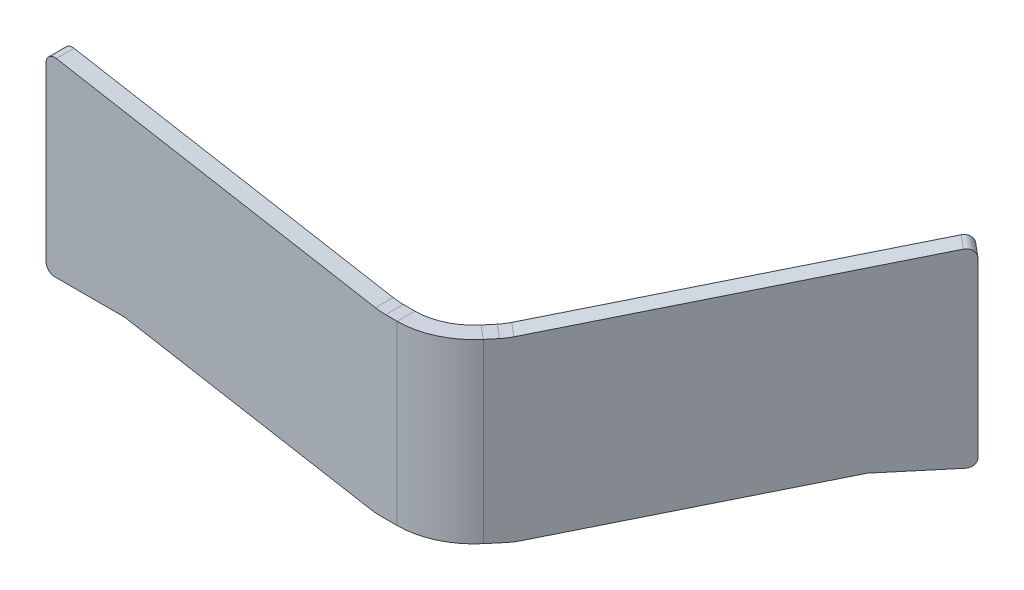
ISO-10303-21;
HEADER;
FILE_DESCRIPTION(('STEP AP214'),'2;1');
FILE_NAME('part.step','',(''),(''),'','','');
FILE_SCHEMA(('AUTOMOTIVE_DESIGN { 1 0 10303 214 1 1 1 1 }'));
ENDSEC;
DATA;
#1=APPLICATION_CONTEXT('core data for automotive mechanical design processes');
#2=APPLICATION_PROTOCOL_DEFINITION('international standard','automotive_design',2000,#1);
#3=PRODUCT_CONTEXT('',#1,'mechanical');
#4=PRODUCT('Part','Part','',(#3));
#5=PRODUCT_RELATED_PRODUCT_CATEGORY('part','',(#4));
#6=PRODUCT_DEFINITION_FORMATION('','',#4);
#7=PRODUCT_DEFINITION_CONTEXT('part definition',#1,'design');
#8=PRODUCT_DEFINITION('design','',#6,#7);
#9=PRODUCT_DEFINITION_SHAPE('','',#8);
#10=(LENGTH_UNIT() NAMED_UNIT(*) SI_UNIT(.MILLI.,.METRE.));
#11=(NAMED_UNIT(*) PLANE_ANGLE_UNIT() SI_UNIT($,.RADIAN.));
#12=(NAMED_UNIT(*) SI_UNIT($,.STERADIAN.) SOLID_ANGLE_UNIT());
#13=UNCERTAINTY_MEASURE_WITH_UNIT(LENGTH_MEASURE(1.E-05),#10,'distance_accuracy_value','');
#14=(GEOMETRIC_REPRESENTATION_CONTEXT(3) GLOBAL_UNCERTAINTY_ASSIGNED_CONTEXT((#13)) GLOBAL_UNIT_ASSIGNED_CONTEXT((#10,
#11,#12)) REPRESENTATION_CONTEXT('',''));
#15=CARTESIAN_POINT('',(0.,0.,0.));
#16=DIRECTION('',(0.,0.,1.));
#17=DIRECTION('',(1.,0.,0.));
#18=AXIS2_PLACEMENT_3D('',#15,#16,#17);
#19=CARTESIAN_POINT('',(84.6111995869186,-29.2123696111087,-92.2096152605912));
#20=DIRECTION('',(0.766044443118979,0.,0.642787609686538));
#21=DIRECTION('',(0.642787609686538,0.,-0.766044443118979));
#22=AXIS2_PLACEMENT_3D('',#19,#20,#21);
#23=PLANE('',#22);
#24=DIRECTION('',(0.642787609686538,0.,-0.766044443118979));
#25=VECTOR('',#24,1.);
#26=CARTESIAN_POINT('',(-5.26631461128302,12.7876303888913,14.902235178553));
#27=LINE('',#26,#25);
#28=CARTESIAN_POINT('',(9.99670405275767,12.7876303888913,-3.28752214815001));
#29=VERTEX_POINT('',#28);
#30=CARTESIAN_POINT('',(12.5062361441126,12.7876303888913,-6.27826603375275));
#31=VERTEX_POINT('',#30);
#32=EDGE_CURVE('E201',#29,#31,#27,.T.);
#33=ORIENTED_EDGE('',*,*,#32,.F.);
#34=DIRECTION('',(0.,-1.,0.));
#35=VECTOR('',#34,1.);
#36=CARTESIAN_POINT('',(9.99670405275767,-29.2123696111087,-3.28752214815001));
#37=LINE('',#36,#35);
#38=CARTESIAN_POINT('',(9.99670405275766,-47.2123696111086,-3.28752214815001));
#39=VERTEX_POINT('',#38);
#40=EDGE_CURVE('E47',#29,#39,#37,.T.);
#41=ORIENTED_EDGE('',*,*,#40,.T.);
#42=DIRECTION('',(0.642787609686538,0.,-0.766044443118979));
#43=VECTOR('',#42,1.);
#44=CARTESIAN_POINT('',(-6.37395997421112,-47.2123696111086,16.2222755191429));
#45=LINE('',#44,#43);
#46=CARTESIAN_POINT('',(13.6138815070407,-47.2123696111086,-7.59830637434266));
#47=VERTEX_POINT('',#46);
#48=EDGE_CURVE('E146',#39,#47,#45,.T.);
#49=ORIENTED_EDGE('',*,*,#48,.T.);
#50=CARTESIAN_POINT('',(13.6138815070407,-27.2123696111086,-7.59830637434265));
#51=DIRECTION('',(-0.766044443118979,0.,-0.642787609686538));
#52=DIRECTION('',(-0.642787609686538,0.,0.766044443118979));
#53=AXIS2_PLACEMENT_3D('',#50,#51,#52);
#54=CIRCLE('',#53,20.);
#55=CARTESIAN_POINT('',(15.8462594480198,-46.9085246713527,-10.2587508055325));
#56=VERTEX_POINT('',#55);
#57=EDGE_CURVE('E131',#56,#47,#54,.T.);
#58=ORIENTED_EDGE('',*,*,#57,.F.);
#59=DIRECTION('',(-0.633022221559488,-0.173648177666927,0.754406506735491));
#60=VECTOR('',#59,1.);
#61=CARTESIAN_POINT('',(69.4200593554533,-32.2123696111086,-74.10551931414));
#62=LINE('',#61,#60);
#63=CARTESIAN_POINT('',(69.4200593554533,-32.2123696111086,-74.10551931414));
#64=VERTEX_POINT('',#63);
#65=EDGE_CURVE('E143',#64,#56,#62,.T.);
#66=ORIENTED_EDGE('',*,*,#65,.F.);
#67=DIRECTION('',(-0.642787609686538,0.,0.766044443118979));
#68=VECTOR('',#67,1.);
#69=CARTESIAN_POINT('',(84.6111995869186,-32.2123696111087,-92.2096152605912));
#70=LINE('',#69,#68);
#71=CARTESIAN_POINT('',(84.6111995869186,-32.2123696111087,-92.2096152605912));
#72=VERTEX_POINT('',#71);
#73=EDGE_CURVE('E150',#72,#64,#70,.T.);
#74=ORIENTED_EDGE('',*,*,#73,.F.);
#75=CARTESIAN_POINT('',(84.6111995869186,-29.2123696111087,-92.2096152605912));
#76=DIRECTION('',(0.766044443118979,0.,0.642787609686538));
#77=DIRECTION('',(0.642787609686538,0.,-0.766044443118979));
#78=AXIS2_PLACEMENT_3D('',#75,#76,#77);
#79=CIRCLE('',#78,2.99999999999998);
#80=CARTESIAN_POINT('',(86.5395624159782,-29.2123696111087,-94.5077485899482));
#81=VERTEX_POINT('',#80);
#82=EDGE_CURVE('E105',#72,#81,#79,.T.);
#83=ORIENTED_EDGE('',*,*,#82,.T.);
#84=DIRECTION('',(0.,-1.,0.));
#85=VECTOR('',#84,1.);
#86=CARTESIAN_POINT('',(86.5395624159782,29.2123696111087,-94.5077485899482));
#87=LINE('',#86,#85);
#88=CARTESIAN_POINT('',(86.5395624159782,29.2123696111087,-94.5077485899482));
#89=VERTEX_POINT('',#88);
#90=EDGE_CURVE('E220',#89,#81,#87,.T.);
#91=ORIENTED_EDGE('',*,*,#90,.F.);
#92=CARTESIAN_POINT('',(84.6111995869186,29.2123696111087,-92.2096152605912));
#93=DIRECTION('',(0.766044443118979,0.,0.642787609686538));
#94=DIRECTION('',(0.642787609686538,0.,-0.766044443118979));
#95=AXIS2_PLACEMENT_3D('',#92,#93,#94);
#96=CIRCLE('',#95,2.99999999999999);
#97=CARTESIAN_POINT('',(84.2763428957717,32.1667928701453,-91.8105485959127));
#98=VERTEX_POINT('',#97);
#99=EDGE_CURVE('E218',#89,#98,#96,.T.);
#100=ORIENTED_EDGE('',*,*,#99,.T.);
#101=DIRECTION('',(-0.633022221559488,-0.173648177666931,0.75440650673549));
#102=VECTOR('',#101,1.);
#103=CARTESIAN_POINT('',(84.2763428957717,32.1667928701453,-91.8105485959127));
#104=LINE('',#103,#102);
#105=CARTESIAN_POINT('',(14.7386140850916,13.0914753286472,-8.93871046494255));
#106=VERTEX_POINT('',#105);
#107=EDGE_CURVE('E216',#98,#106,#104,.T.);
#108=ORIENTED_EDGE('',*,*,#107,.T.);
#109=CARTESIAN_POINT('',(12.5062361441126,32.7876303888913,-6.27826603375275));
#110=DIRECTION('',(-0.766044443118979,0.,-0.642787609686538));
#111=DIRECTION('',(-0.642787609686538,0.,0.766044443118979));
#112=AXIS2_PLACEMENT_3D('',#109,#110,#111);
#113=CIRCLE('',#112,20.);
#114=EDGE_CURVE('E212',#106,#31,#113,.T.);
#115=ORIENTED_EDGE('',*,*,#114,.T.);
#116=EDGE_LOOP('',(#33,#41,#49,#58,#66,#74,#83,#91,#100,#108,#115));
#117=FACE_BOUND('',#116,.T.);
#118=ADVANCED_FACE('F39',(#117),#23,.T.);
#119=CARTESIAN_POINT('',(-5.26631461128302,12.7876303888913,14.902235178553));
#120=DIRECTION('',(0.,1.,0.));
#121=DIRECTION('',(-0.642787609686538,0.,0.766044443118979));
#122=AXIS2_PLACEMENT_3D('',#119,#120,#121);
#123=PLANE('',#122);
#124=DIRECTION('',(0.642787609686538,0.,-0.766044443118979));
#125=VECTOR('',#124,1.);
#126=CARTESIAN_POINT('',(-9.86258126999689,12.7876303888913,11.0455095204338));
#127=LINE('',#126,#125);
#128=CARTESIAN_POINT('',(5.40043739404379,12.7876303888913,-7.14424780626924));
#129=VERTEX_POINT('',#128);
#130=CARTESIAN_POINT('',(7.90996948539874,12.7876303888913,-10.134991691872));
#131=VERTEX_POINT('',#130);
#132=EDGE_CURVE('E168',#129,#131,#127,.T.);
#133=ORIENTED_EDGE('',*,*,#132,.F.);
#134=DIRECTION('',(0.766044443118979,0.,0.642787609686538));
#135=VECTOR('',#134,1.);
#136=CARTESIAN_POINT('',(9.99670405275767,12.7876303888913,-3.28752214815001));
#137=LINE('',#136,#135);
#138=EDGE_CURVE('E194',#129,#29,#137,.T.);
#139=ORIENTED_EDGE('',*,*,#138,.T.);
#140=ORIENTED_EDGE('',*,*,#32,.T.);
#141=DIRECTION('',(-0.766044443118979,0.,-0.642787609686538));
#142=VECTOR('',#141,1.);
#143=CARTESIAN_POINT('',(12.5062361441126,12.7876303888913,-6.27826603375275));
#144=LINE('',#143,#142);
#145=EDGE_CURVE('E181',#31,#131,#144,.T.);
#146=ORIENTED_EDGE('',*,*,#145,.T.);
#147=EDGE_LOOP('',(#133,#139,#140,#146));
#148=FACE_BOUND('',#147,.T.);
#149=ADVANCED_FACE('F441',(#148),#123,.T.);
#150=CARTESIAN_POINT('',(84.6111995869186,-29.2123696111087,-92.2096152605912));
#151=DIRECTION('',(-0.766044443118979,0.,-0.642787609686538));
#152=DIRECTION('',(-0.642787609686538,0.,0.766044443118979));
#153=AXIS2_PLACEMENT_3D('',#150,#151,#152);
#154=CYLINDRICAL_SURFACE('',#153,2.99999999999998);
#155=CARTESIAN_POINT('',(80.0149329282047,-29.2123696111087,-96.0663409187105));
#156=DIRECTION('',(0.766044443118979,0.,0.642787609686538));
#157=DIRECTION('',(0.642787609686538,0.,-0.766044443118979));
#158=AXIS2_PLACEMENT_3D('',#155,#156,#157);
#159=CIRCLE('',#158,2.99999999999998);
#160=CARTESIAN_POINT('',(80.0149329282047,-32.2123696111087,-96.0663409187105));
#161=VERTEX_POINT('',#160);
#162=CARTESIAN_POINT('',(81.9432957572643,-29.2123696111087,-98.3644742480674));
#163=VERTEX_POINT('',#162);
#164=EDGE_CURVE('E155',#161,#163,#159,.T.);
#165=ORIENTED_EDGE('',*,*,#164,.T.);
#166=DIRECTION('',(-0.766044443118979,0.,-0.642787609686538));
#167=VECTOR('',#166,1.);
#168=CARTESIAN_POINT('',(86.5395624159782,-29.2123696111087,-94.5077485899482));
#169=LINE('',#168,#167);
#170=EDGE_CURVE('E192',#81,#163,#169,.T.);
#171=ORIENTED_EDGE('',*,*,#170,.F.);
#172=ORIENTED_EDGE('',*,*,#82,.F.);
#173=DIRECTION('',(-0.766044443118979,0.,-0.642787609686538));
#174=VECTOR('',#173,1.);
#175=CARTESIAN_POINT('',(84.6111995869186,-32.2123696111087,-92.2096152605912));
#176=LINE('',#175,#174);
#177=EDGE_CURVE('E63',#72,#161,#176,.T.);
#178=ORIENTED_EDGE('',*,*,#177,.T.);
#179=EDGE_LOOP('',(#165,#171,#172,#178));
#180=FACE_BOUND('',#179,.T.);
#181=ADVANCED_FACE('F41',(#180),#154,.T.);
#182=CARTESIAN_POINT('',(86.5395624159782,29.2123696111087,-94.5077485899482));
#183=DIRECTION('',(0.642787609686538,0.,-0.766044443118979));
#184=DIRECTION('',(-0.766044443118979,0.,-0.642787609686538));
#185=AXIS2_PLACEMENT_3D('',#182,#183,#184);
#186=PLANE('',#185);
#187=DIRECTION('',(0.,-1.,0.));
#188=VECTOR('',#187,1.);
#189=CARTESIAN_POINT('',(81.9432957572643,29.2123696111087,-98.3644742480674));
#190=LINE('',#189,#188);
#191=CARTESIAN_POINT('',(81.9432957572643,29.2123696111087,-98.3644742480674));
#192=VERTEX_POINT('',#191);
#193=EDGE_CURVE('E157',#192,#163,#190,.T.);
#194=ORIENTED_EDGE('',*,*,#193,.F.);
#195=DIRECTION('',(-0.766044443118979,0.,-0.642787609686538));
#196=VECTOR('',#195,1.);
#197=CARTESIAN_POINT('',(86.5395624159782,29.2123696111087,-94.5077485899482));
#198=LINE('',#197,#196);
#199=EDGE_CURVE('E190',#89,#192,#198,.T.);
#200=ORIENTED_EDGE('',*,*,#199,.F.);
#201=ORIENTED_EDGE('',*,*,#90,.T.);
#202=ORIENTED_EDGE('',*,*,#170,.T.);
#203=EDGE_LOOP('',(#194,#200,#201,#202));
#204=FACE_BOUND('',#203,.T.);
#205=ADVANCED_FACE('F474',(#204),#186,.T.);
#206=CARTESIAN_POINT('',(84.6111995869186,29.2123696111087,-92.2096152605912));
#207=DIRECTION('',(-0.766044443118979,0.,-0.642787609686538));
#208=DIRECTION('',(-0.642787609686538,0.,0.766044443118979));
#209=AXIS2_PLACEMENT_3D('',#206,#207,#208);
#210=CYLINDRICAL_SURFACE('',#209,2.99999999999999);
#211=CARTESIAN_POINT('',(80.0149329282047,29.2123696111087,-96.0663409187105));
#212=DIRECTION('',(0.766044443118979,0.,0.642787609686538));
#213=DIRECTION('',(0.642787609686538,0.,-0.766044443118979));
#214=AXIS2_PLACEMENT_3D('',#211,#212,#213);
#215=CIRCLE('',#214,2.99999999999999);
#216=CARTESIAN_POINT('',(79.6800762370578,32.1667928701453,-95.667274254032));
#217=VERTEX_POINT('',#216);
#218=EDGE_CURVE('E161',#192,#217,#215,.T.);
#219=ORIENTED_EDGE('',*,*,#218,.T.);
#220=DIRECTION('',(-0.766044443118979,0.,-0.642787609686538));
#221=VECTOR('',#220,1.);
#222=CARTESIAN_POINT('',(84.2763428957717,32.1667928701453,-91.8105485959127));
#223=LINE('',#222,#221);
#224=EDGE_CURVE('E187',#98,#217,#223,.T.);
#225=ORIENTED_EDGE('',*,*,#224,.F.);
#226=ORIENTED_EDGE('',*,*,#99,.F.);
#227=ORIENTED_EDGE('',*,*,#199,.T.);
#228=EDGE_LOOP('',(#219,#225,#226,#227));
#229=FACE_BOUND('',#228,.T.);
#230=ADVANCED_FACE('F471',(#229),#210,.T.);
#231=CARTESIAN_POINT('',(84.2763428957717,32.1667928701453,-91.8105485959127));
#232=DIRECTION('',(0.11161889704895,-0.984807753012208,-0.13302222155949));
#233=DIRECTION('',(0.633022221559488,0.173648177666931,-0.75440650673549));
#234=AXIS2_PLACEMENT_3D('',#231,#232,#233);
#235=PLANE('',#234);
#236=DIRECTION('',(-0.633022221559488,-0.173648177666931,0.75440650673549));
#237=VECTOR('',#236,1.);
#238=CARTESIAN_POINT('',(79.6800762370578,32.1667928701453,-95.667274254032));
#239=LINE('',#238,#237);
#240=CARTESIAN_POINT('',(10.1423474263777,13.0914753286472,-12.7954361230618));
#241=VERTEX_POINT('',#240);
#242=EDGE_CURVE('E163',#217,#241,#239,.T.);
#243=ORIENTED_EDGE('',*,*,#242,.T.);
#244=DIRECTION('',(-0.766044443118979,0.,-0.642787609686538));
#245=VECTOR('',#244,1.);
#246=CARTESIAN_POINT('',(14.7386140850916,13.0914753286472,-8.93871046494255));
#247=LINE('',#246,#245);
#248=EDGE_CURVE('E184',#106,#241,#247,.T.);
#249=ORIENTED_EDGE('',*,*,#248,.F.);
#250=ORIENTED_EDGE('',*,*,#107,.F.);
#251=ORIENTED_EDGE('',*,*,#224,.T.);
#252=EDGE_LOOP('',(#243,#249,#250,#251));
#253=FACE_BOUND('',#252,.T.);
#254=ADVANCED_FACE('F467',(#253),#235,.F.);
#255=CARTESIAN_POINT('',(12.5062361441126,32.7876303888913,-6.27826603375275));
#256=DIRECTION('',(-0.766044443118979,0.,-0.642787609686538));
#257=DIRECTION('',(-0.642787609686538,0.,0.766044443118979));
#258=AXIS2_PLACEMENT_3D('',#255,#256,#257);
#259=CYLINDRICAL_SURFACE('',#258,20.);
#260=CARTESIAN_POINT('',(7.90996948539874,32.7876303888913,-10.134991691872));
#261=DIRECTION('',(-0.766044443118979,0.,-0.642787609686538));
#262=DIRECTION('',(-0.642787609686538,0.,0.766044443118979));
#263=AXIS2_PLACEMENT_3D('',#260,#261,#262);
#264=CIRCLE('',#263,20.);
#265=EDGE_CURVE('E165',#241,#131,#264,.T.);
#266=ORIENTED_EDGE('',*,*,#265,.T.);
#267=ORIENTED_EDGE('',*,*,#145,.F.);
#268=ORIENTED_EDGE('',*,*,#114,.F.);
#269=ORIENTED_EDGE('',*,*,#248,.T.);
#270=EDGE_LOOP('',(#266,#267,#268,#269));
#271=FACE_BOUND('',#270,.T.);
#272=ADVANCED_FACE('F463',(#271),#259,.F.);
#273=CARTESIAN_POINT('',(-6.37395997421112,-47.2123696111086,16.2222755191429));
#274=DIRECTION('',(0.,1.,0.));
#275=DIRECTION('',(-0.642787609686538,0.,0.766044443118979));
#276=AXIS2_PLACEMENT_3D('',#273,#274,#275);
#277=PLANE('',#276);
#278=DIRECTION('',(0.766044443118979,0.,0.642787609686538));
#279=VECTOR('',#278,1.);
#280=CARTESIAN_POINT('',(9.99670405275767,-47.2123696111086,-3.28752214815001));
#281=LINE('',#280,#279);
#282=CARTESIAN_POINT('',(5.40043739404379,-47.2123696111086,-7.14424780626924));
#283=VERTEX_POINT('',#282);
#284=EDGE_CURVE('E197',#283,#39,#281,.T.);
#285=ORIENTED_EDGE('',*,*,#284,.F.);
#286=DIRECTION('',(0.642787609686538,0.,-0.766044443118979));
#287=VECTOR('',#286,1.);
#288=CARTESIAN_POINT('',(-10.970226632925,-47.2123696111086,12.3655498610237));
#289=LINE('',#288,#287);
#290=CARTESIAN_POINT('',(9.01761484832687,-47.2123696111086,-11.4550320324619));
#291=VERTEX_POINT('',#290);
#292=EDGE_CURVE('E170',#283,#291,#289,.T.);
#293=ORIENTED_EDGE('',*,*,#292,.T.);
#294=DIRECTION('',(-0.766044443118979,0.,-0.642787609686538));
#295=VECTOR('',#294,1.);
#296=CARTESIAN_POINT('',(13.6138815070407,-47.2123696111086,-7.59830637434266));
#297=LINE('',#296,#295);
#298=EDGE_CURVE('E138',#47,#291,#297,.T.);
#299=ORIENTED_EDGE('',*,*,#298,.F.);
#300=ORIENTED_EDGE('',*,*,#48,.F.);
#301=EDGE_LOOP('',(#285,#293,#299,#300));
#302=FACE_BOUND('',#301,.T.);
#303=ADVANCED_FACE('F209',(#302),#277,.F.);
#304=CARTESIAN_POINT('',(13.6138815070407,-27.2123696111086,-7.59830637434265));
#305=DIRECTION('',(-0.766044443118979,0.,-0.642787609686538));
#306=DIRECTION('',(-0.642787609686538,0.,0.766044443118979));
#307=AXIS2_PLACEMENT_3D('',#304,#305,#306);
#308=CYLINDRICAL_SURFACE('',#307,20.);
#309=CARTESIAN_POINT('',(9.01761484832685,-27.2123696111086,-11.4550320324619));
#310=DIRECTION('',(-0.766044443118979,0.,-0.642787609686538));
#311=DIRECTION('',(-0.642787609686538,0.,0.766044443118979));
#312=AXIS2_PLACEMENT_3D('',#309,#310,#311);
#313=CIRCLE('',#312,20.);
#314=CARTESIAN_POINT('',(11.2499927893059,-46.9085246713527,-14.1154764636518));
#315=VERTEX_POINT('',#314);
#316=EDGE_CURVE('E133',#315,#291,#313,.T.);
#317=ORIENTED_EDGE('',*,*,#316,.F.);
#318=DIRECTION('',(-0.766044443118979,0.,-0.642787609686538));
#319=VECTOR('',#318,1.);
#320=CARTESIAN_POINT('',(15.8462594480198,-46.9085246713527,-10.2587508055325));
#321=LINE('',#320,#319);
#322=EDGE_CURVE('E127',#56,#315,#321,.T.);
#323=ORIENTED_EDGE('',*,*,#322,.F.);
#324=ORIENTED_EDGE('',*,*,#57,.T.);
#325=ORIENTED_EDGE('',*,*,#298,.T.);
#326=EDGE_LOOP('',(#317,#323,#324,#325));
#327=FACE_BOUND('',#326,.T.);
#328=ADVANCED_FACE('F129',(#327),#308,.T.);
#329=CARTESIAN_POINT('',(69.4200593554533,-32.2123696111086,-74.10551931414));
#330=DIRECTION('',(0.111618897048947,-0.984807753012208,-0.133022221559487));
#331=DIRECTION('',(0.633022221559488,0.173648177666927,-0.754406506735491));
#332=AXIS2_PLACEMENT_3D('',#329,#330,#331);
#333=PLANE('',#332);
#334=DIRECTION('',(-0.633022221559488,-0.173648177666927,0.754406506735491));
#335=VECTOR('',#334,1.);
#336=CARTESIAN_POINT('',(64.8237926967395,-32.2123696111086,-77.9622449722593));
#337=LINE('',#336,#335);
#338=CARTESIAN_POINT('',(64.8237926967395,-32.2123696111086,-77.9622449722593));
#339=VERTEX_POINT('',#338);
#340=EDGE_CURVE('E173',#339,#315,#337,.T.);
#341=ORIENTED_EDGE('',*,*,#340,.F.);
#342=DIRECTION('',(-0.766044443118979,0.,-0.642787609686538));
#343=VECTOR('',#342,1.);
#344=CARTESIAN_POINT('',(69.4200593554533,-32.2123696111086,-74.10551931414));
#345=LINE('',#344,#343);
#346=EDGE_CURVE('E139',#64,#339,#345,.T.);
#347=ORIENTED_EDGE('',*,*,#346,.F.);
#348=ORIENTED_EDGE('',*,*,#65,.T.);
#349=ORIENTED_EDGE('',*,*,#322,.T.);
#350=EDGE_LOOP('',(#341,#347,#348,#349));
#351=FACE_BOUND('',#350,.T.);
#352=ADVANCED_FACE('F149',(#351),#333,.T.);
#353=CARTESIAN_POINT('',(84.6111995869186,-32.2123696111087,-92.2096152605912));
#354=DIRECTION('',(0.,-1.,0.));
#355=DIRECTION('',(0.642787609686538,0.,-0.766044443118979));
#356=AXIS2_PLACEMENT_3D('',#353,#354,#355);
#357=PLANE('',#356);
#358=DIRECTION('',(-0.642787609686538,0.,0.766044443118979));
#359=VECTOR('',#358,1.);
#360=CARTESIAN_POINT('',(80.0149329282047,-32.2123696111087,-96.0663409187105));
#361=LINE('',#360,#359);
#362=EDGE_CURVE('E175',#161,#339,#361,.T.);
#363=ORIENTED_EDGE('',*,*,#362,.F.);
#364=ORIENTED_EDGE('',*,*,#177,.F.);
#365=ORIENTED_EDGE('',*,*,#73,.T.);
#366=ORIENTED_EDGE('',*,*,#346,.T.);
#367=EDGE_LOOP('',(#363,#364,#365,#366));
#368=FACE_BOUND('',#367,.T.);
#369=ADVANCED_FACE('F454',(#368),#357,.T.);
#370=CARTESIAN_POINT('',(80.0149329282047,-29.2123696111087,-96.0663409187105));
#371=DIRECTION('',(0.766044443118979,0.,0.642787609686538));
#372=DIRECTION('',(0.642787609686538,0.,-0.766044443118979));
#373=AXIS2_PLACEMENT_3D('',#370,#371,#372);
#374=PLANE('',#373);
#375=DIRECTION('',(0.,-1.,0.));
#376=VECTOR('',#375,1.);
#377=CARTESIAN_POINT('',(5.40043739404379,-29.2123696111087,-7.14424780626924));
#378=LINE('',#377,#376);
#379=EDGE_CURVE('E11',#129,#283,#378,.T.);
#380=ORIENTED_EDGE('',*,*,#379,.F.);
#381=ORIENTED_EDGE('',*,*,#132,.T.);
#382=ORIENTED_EDGE('',*,*,#265,.F.);
#383=ORIENTED_EDGE('',*,*,#242,.F.);
#384=ORIENTED_EDGE('',*,*,#218,.F.);
#385=ORIENTED_EDGE('',*,*,#193,.T.);
#386=ORIENTED_EDGE('',*,*,#164,.F.);
#387=ORIENTED_EDGE('',*,*,#362,.T.);
#388=ORIENTED_EDGE('',*,*,#340,.T.);
#389=ORIENTED_EDGE('',*,*,#316,.T.);
#390=ORIENTED_EDGE('',*,*,#292,.F.);
#391=EDGE_LOOP('',(#380,#381,#382,#383,#384,#385,#386,#387,#388,#389,#390));
#392=FACE_BOUND('',#391,.T.);
#393=ADVANCED_FACE('F451',(#392),#374,.F.);
#394=CARTESIAN_POINT('',(-15.5477806199462,-47.2123696111086,6.));
#395=DIRECTION('',(0.,1.,0.));
#396=DIRECTION('',(-1.,0.,0.));
#397=AXIS2_PLACEMENT_3D('',#394,#395,#396);
#398=PLANE('',#397);
#399=DIRECTION('',(1.,0.,0.));
#400=VECTOR('',#399,1.);
#401=CARTESIAN_POINT('',(-15.5477806199462,-47.2123696111086,0.));
#402=LINE('',#401,#400);
#403=CARTESIAN_POINT('',(-15.5477806199462,-47.2123696111086,0.));
#404=VERTEX_POINT('',#403);
#405=CARTESIAN_POINT('',(-9.92045146833579,-47.2123696111086,0.));
#406=VERTEX_POINT('',#405);
#407=EDGE_CURVE('E262',#404,#406,#402,.T.);
#408=ORIENTED_EDGE('',*,*,#407,.T.);
#409=DIRECTION('',(0.,0.,1.));
#410=VECTOR('',#409,1.);
#411=CARTESIAN_POINT('',(-9.92045146833579,-47.2123696111086,6.));
#412=LINE('',#411,#410);
#413=CARTESIAN_POINT('',(-9.92045146833578,-47.2123696111086,6.));
#414=VERTEX_POINT('',#413);
#415=EDGE_CURVE('E228',#406,#414,#412,.T.);
#416=ORIENTED_EDGE('',*,*,#415,.T.);
#417=DIRECTION('',(1.,0.,0.));
#418=VECTOR('',#417,1.);
#419=CARTESIAN_POINT('',(-15.5477806199462,-47.2123696111086,6.));
#420=LINE('',#419,#418);
#421=CARTESIAN_POINT('',(-15.5477806199462,-47.2123696111086,6.));
#422=VERTEX_POINT('',#421);
#423=EDGE_CURVE('E261',#422,#414,#420,.T.);
#424=ORIENTED_EDGE('',*,*,#423,.F.);
#425=DIRECTION('',(0.,0.,-1.));
#426=VECTOR('',#425,1.);
#427=CARTESIAN_POINT('',(-15.5477806199462,-47.2123696111086,6.));
#428=LINE('',#427,#426);
#429=EDGE_CURVE('E258',#422,#404,#428,.T.);
#430=ORIENTED_EDGE('',*,*,#429,.T.);
#431=EDGE_LOOP('',(#408,#416,#424,#430));
#432=FACE_BOUND('',#431,.T.);
#433=ADVANCED_FACE('F411',(#432),#398,.F.);
#434=CARTESIAN_POINT('',(126.,-29.2123696111087,0.));
#435=DIRECTION('',(0.,0.,1.));
#436=DIRECTION('',(1.,0.,0.));
#437=AXIS2_PLACEMENT_3D('',#434,#435,#436);
#438=PLANE('',#437);
#439=DIRECTION('',(1.,0.,0.));
#440=VECTOR('',#439,1.);
#441=CARTESIAN_POINT('',(-13.8245903371275,12.7876303888913,0.));
#442=LINE('',#441,#440);
#443=CARTESIAN_POINT('',(-13.8245903371275,12.7876303888913,0.));
#444=VERTEX_POINT('',#443);
#445=CARTESIAN_POINT('',(-9.92045146833579,12.7876303888913,0.));
#446=VERTEX_POINT('',#445);
#447=EDGE_CURVE('E290',#444,#446,#442,.T.);
#448=ORIENTED_EDGE('',*,*,#447,.T.);
#449=DIRECTION('',(0.,-1.,0.));
#450=VECTOR('',#449,1.);
#451=CARTESIAN_POINT('',(-9.92045146833578,-29.2123696111087,0.));
#452=LINE('',#451,#450);
#453=EDGE_CURVE('E231',#446,#406,#452,.T.);
#454=ORIENTED_EDGE('',*,*,#453,.T.);
#455=ORIENTED_EDGE('',*,*,#407,.F.);
#456=CARTESIAN_POINT('',(-15.5477806199462,-27.2123696111086,0.));
#457=DIRECTION('',(0.,0.,1.));
#458=DIRECTION('',(1.,0.,0.));
#459=AXIS2_PLACEMENT_3D('',#456,#457,#458);
#460=CIRCLE('',#459,20.);
#461=CARTESIAN_POINT('',(-19.0207441732848,-46.9085246713527,0.));
#462=VERTEX_POINT('',#461);
#463=EDGE_CURVE('E266',#462,#404,#460,.T.);
#464=ORIENTED_EDGE('',*,*,#463,.F.);
#465=DIRECTION('',(0.984807753012208,-0.17364817766693,0.));
#466=VECTOR('',#465,1.);
#467=CARTESIAN_POINT('',(-102.36678118473,-32.2123696111087,0.));
#468=LINE('',#467,#466);
#469=CARTESIAN_POINT('',(-102.36678118473,-32.2123696111087,0.));
#470=VERTEX_POINT('',#469);
#471=EDGE_CURVE('E269',#470,#462,#468,.T.);
#472=ORIENTED_EDGE('',*,*,#471,.F.);
#473=DIRECTION('',(-1.,0.,0.));
#474=VECTOR('',#473,1.);
#475=CARTESIAN_POINT('',(-102.36678118473,-32.2123696111087,0.));
#476=LINE('',#475,#474);
#477=CARTESIAN_POINT('',(-126.,-32.2123696111087,0.));
#478=VERTEX_POINT('',#477);
#479=EDGE_CURVE('E272',#470,#478,#476,.T.);
#480=ORIENTED_EDGE('',*,*,#479,.T.);
#481=CARTESIAN_POINT('',(-126.,-29.2123696111087,0.));
#482=DIRECTION('',(0.,0.,-1.));
#483=DIRECTION('',(-1.,0.,0.));
#484=AXIS2_PLACEMENT_3D('',#481,#482,#483);
#485=CIRCLE('',#484,2.99999999999998);
#486=CARTESIAN_POINT('',(-129.,-29.2123696111087,0.));
#487=VERTEX_POINT('',#486);
#488=EDGE_CURVE('E275',#478,#487,#485,.T.);
#489=ORIENTED_EDGE('',*,*,#488,.T.);
#490=DIRECTION('',(0.,-1.,0.));
#491=VECTOR('',#490,1.);
#492=CARTESIAN_POINT('',(-129.,29.2123696111087,0.));
#493=LINE('',#492,#491);
#494=CARTESIAN_POINT('',(-129.,29.2123696111087,0.));
#495=VERTEX_POINT('',#494);
#496=EDGE_CURVE('E278',#495,#487,#493,.T.);
#497=ORIENTED_EDGE('',*,*,#496,.F.);
#498=CARTESIAN_POINT('',(-126.,29.2123696111087,0.));
#499=DIRECTION('',(0.,0.,-1.));
#500=DIRECTION('',(-1.,0.,0.));
#501=AXIS2_PLACEMENT_3D('',#498,#499,#500);
#502=CIRCLE('',#501,2.99999999999999);
#503=CARTESIAN_POINT('',(-125.479055466999,32.1667928701453,0.));
#504=VERTEX_POINT('',#503);
#505=EDGE_CURVE('E281',#495,#504,#502,.T.);
#506=ORIENTED_EDGE('',*,*,#505,.T.);
#507=DIRECTION('',(0.984807753012208,-0.173648177666931,0.));
#508=VECTOR('',#507,1.);
#509=CARTESIAN_POINT('',(-125.479055466999,32.1667928701453,0.));
#510=LINE('',#509,#508);
#511=CARTESIAN_POINT('',(-17.2975538904662,13.0914753286472,0.));
#512=VERTEX_POINT('',#511);
#513=EDGE_CURVE('E284',#504,#512,#510,.T.);
#514=ORIENTED_EDGE('',*,*,#513,.T.);
#515=CARTESIAN_POINT('',(-13.8245903371275,32.7876303888913,0.));
#516=DIRECTION('',(0.,0.,1.));
#517=DIRECTION('',(1.,0.,0.));
#518=AXIS2_PLACEMENT_3D('',#515,#516,#517);
#519=CIRCLE('',#518,20.);
#520=EDGE_CURVE('E287',#512,#444,#519,.T.);
#521=ORIENTED_EDGE('',*,*,#520,.T.);
#522=EDGE_LOOP('',(#448,#454,#455,#464,#472,#480,#489,#497,#506,#514,#521));
#523=FACE_BOUND('',#522,.T.);
#524=ADVANCED_FACE('F406',(#523),#438,.F.);
#525=CARTESIAN_POINT('',(-13.8245903371275,12.7876303888913,6.));
#526=DIRECTION('',(0.,1.,0.));
#527=DIRECTION('',(-1.,0.,0.));
#528=AXIS2_PLACEMENT_3D('',#525,#526,#527);
#529=PLANE('',#528);
#530=DIRECTION('',(0.,0.,1.));
#531=VECTOR('',#530,1.);
#532=CARTESIAN_POINT('',(-9.92045146833579,12.7876303888913,6.));
#533=LINE('',#532,#531);
#534=CARTESIAN_POINT('',(-9.92045146833579,12.7876303888913,6.));
#535=VERTEX_POINT('',#534);
#536=EDGE_CURVE('E226',#446,#535,#533,.T.);
#537=ORIENTED_EDGE('',*,*,#536,.F.);
#538=ORIENTED_EDGE('',*,*,#447,.F.);
#539=DIRECTION('',(0.,0.,-1.));
#540=VECTOR('',#539,1.);
#541=CARTESIAN_POINT('',(-13.8245903371275,12.7876303888913,6.));
#542=LINE('',#541,#540);
#543=CARTESIAN_POINT('',(-13.8245903371275,12.7876303888913,6.));
#544=VERTEX_POINT('',#543);
#545=EDGE_CURVE('E234',#544,#444,#542,.T.);
#546=ORIENTED_EDGE('',*,*,#545,.F.);
#547=DIRECTION('',(1.,0.,0.));
#548=VECTOR('',#547,1.);
#549=CARTESIAN_POINT('',(-13.8245903371275,12.7876303888913,6.));
#550=LINE('',#549,#548);
#551=EDGE_CURVE('E265',#544,#535,#550,.T.);
#552=ORIENTED_EDGE('',*,*,#551,.T.);
#553=EDGE_LOOP('',(#537,#538,#546,#552));
#554=FACE_BOUND('',#553,.T.);
#555=ADVANCED_FACE('F415',(#554),#529,.T.);
#556=CARTESIAN_POINT('',(-13.8245903371275,32.7876303888913,6.));
#557=DIRECTION('',(0.,0.,-1.));
#558=DIRECTION('',(-1.,0.,0.));
#559=AXIS2_PLACEMENT_3D('',#556,#557,#558);
#560=CYLINDRICAL_SURFACE('',#559,20.);
#561=ORIENTED_EDGE('',*,*,#520,.F.);
#562=DIRECTION('',(0.,0.,-1.));
#563=VECTOR('',#562,1.);
#564=CARTESIAN_POINT('',(-17.2975538904662,13.0914753286472,6.));
#565=LINE('',#564,#563);
#566=CARTESIAN_POINT('',(-17.2975538904662,13.0914753286472,6.));
#567=VERTEX_POINT('',#566);
#568=EDGE_CURVE('E237',#567,#512,#565,.T.);
#569=ORIENTED_EDGE('',*,*,#568,.F.);
#570=CARTESIAN_POINT('',(-13.8245903371275,32.7876303888913,6.));
#571=DIRECTION('',(0.,0.,1.));
#572=DIRECTION('',(1.,0.,0.));
#573=AXIS2_PLACEMENT_3D('',#570,#571,#572);
#574=CIRCLE('',#573,20.);
#575=EDGE_CURVE('E317',#567,#544,#574,.T.);
#576=ORIENTED_EDGE('',*,*,#575,.T.);
#577=ORIENTED_EDGE('',*,*,#545,.T.);
#578=EDGE_LOOP('',(#561,#569,#576,#577));
#579=FACE_BOUND('',#578,.T.);
#580=ADVANCED_FACE('F423',(#579),#560,.F.);
#581=CARTESIAN_POINT('',(-125.479055466999,32.1667928701453,6.));
#582=DIRECTION('',(0.173648177666931,0.984807753012208,0.));
#583=DIRECTION('',(-0.984807753012208,0.173648177666931,0.));
#584=AXIS2_PLACEMENT_3D('',#581,#582,#583);
#585=PLANE('',#584);
#586=ORIENTED_EDGE('',*,*,#513,.F.);
#587=DIRECTION('',(0.,0.,-1.));
#588=VECTOR('',#587,1.);
#589=CARTESIAN_POINT('',(-125.479055466999,32.1667928701453,6.));
#590=LINE('',#589,#588);
#591=CARTESIAN_POINT('',(-125.479055466999,32.1667928701453,6.));
#592=VERTEX_POINT('',#591);
#593=EDGE_CURVE('E240',#592,#504,#590,.T.);
#594=ORIENTED_EDGE('',*,*,#593,.F.);
#595=DIRECTION('',(0.984807753012208,-0.173648177666931,0.));
#596=VECTOR('',#595,1.);
#597=CARTESIAN_POINT('',(-125.479055466999,32.1667928701453,6.));
#598=LINE('',#597,#596);
#599=EDGE_CURVE('E314',#592,#567,#598,.T.);
#600=ORIENTED_EDGE('',*,*,#599,.T.);
#601=ORIENTED_EDGE('',*,*,#568,.T.);
#602=EDGE_LOOP('',(#586,#594,#600,#601));
#603=FACE_BOUND('',#602,.T.);
#604=ADVANCED_FACE('F426',(#603),#585,.T.);
#605=CARTESIAN_POINT('',(-126.,29.2123696111087,6.));
#606=DIRECTION('',(0.,0.,-1.));
#607=DIRECTION('',(-1.,0.,0.));
#608=AXIS2_PLACEMENT_3D('',#605,#606,#607);
#609=CYLINDRICAL_SURFACE('',#608,2.99999999999999);
#610=ORIENTED_EDGE('',*,*,#505,.F.);
#611=DIRECTION('',(0.,0.,-1.));
#612=VECTOR('',#611,1.);
#613=CARTESIAN_POINT('',(-129.,29.2123696111087,6.));
#614=LINE('',#613,#612);
#615=CARTESIAN_POINT('',(-129.,29.2123696111087,6.));
#616=VERTEX_POINT('',#615);
#617=EDGE_CURVE('E243',#616,#495,#614,.T.);
#618=ORIENTED_EDGE('',*,*,#617,.F.);
#619=CARTESIAN_POINT('',(-126.,29.2123696111087,6.));
#620=DIRECTION('',(0.,0.,-1.));
#621=DIRECTION('',(-1.,0.,0.));
#622=AXIS2_PLACEMENT_3D('',#619,#620,#621);
#623=CIRCLE('',#622,2.99999999999999);
#624=EDGE_CURVE('E311',#616,#592,#623,.T.);
#625=ORIENTED_EDGE('',*,*,#624,.T.);
#626=ORIENTED_EDGE('',*,*,#593,.T.);
#627=EDGE_LOOP('',(#610,#618,#625,#626));
#628=FACE_BOUND('',#627,.T.);
#629=ADVANCED_FACE('F429',(#628),#609,.T.);
#630=CARTESIAN_POINT('',(-129.,29.2123696111087,6.));
#631=DIRECTION('',(1.,0.,0.));
#632=DIRECTION('',(0.,0.,-1.));
#633=AXIS2_PLACEMENT_3D('',#630,#631,#632);
#634=PLANE('',#633);
#635=ORIENTED_EDGE('',*,*,#496,.T.);
#636=DIRECTION('',(0.,0.,-1.));
#637=VECTOR('',#636,1.);
#638=CARTESIAN_POINT('',(-129.,-29.2123696111087,6.));
#639=LINE('',#638,#637);
#640=CARTESIAN_POINT('',(-129.,-29.2123696111087,6.));
#641=VERTEX_POINT('',#640);
#642=EDGE_CURVE('E246',#641,#487,#639,.T.);
#643=ORIENTED_EDGE('',*,*,#642,.F.);
#644=DIRECTION('',(0.,-1.,0.));
#645=VECTOR('',#644,1.);
#646=CARTESIAN_POINT('',(-129.,29.2123696111087,6.));
#647=LINE('',#646,#645);
#648=EDGE_CURVE('E308',#616,#641,#647,.T.);
#649=ORIENTED_EDGE('',*,*,#648,.F.);
#650=ORIENTED_EDGE('',*,*,#617,.T.);
#651=EDGE_LOOP('',(#635,#643,#649,#650));
#652=FACE_BOUND('',#651,.T.);
#653=ADVANCED_FACE('F431',(#652),#634,.F.);
#654=CARTESIAN_POINT('',(-126.,-29.2123696111087,6.));
#655=DIRECTION('',(0.,0.,-1.));
#656=DIRECTION('',(-1.,0.,0.));
#657=AXIS2_PLACEMENT_3D('',#654,#655,#656);
#658=CYLINDRICAL_SURFACE('',#657,2.99999999999998);
#659=ORIENTED_EDGE('',*,*,#488,.F.);
#660=DIRECTION('',(0.,0.,-1.));
#661=VECTOR('',#660,1.);
#662=CARTESIAN_POINT('',(-126.,-32.2123696111087,6.));
#663=LINE('',#662,#661);
#664=CARTESIAN_POINT('',(-126.,-32.2123696111087,6.));
#665=VERTEX_POINT('',#664);
#666=EDGE_CURVE('E249',#665,#478,#663,.T.);
#667=ORIENTED_EDGE('',*,*,#666,.F.);
#668=CARTESIAN_POINT('',(-126.,-29.2123696111087,6.));
#669=DIRECTION('',(0.,0.,-1.));
#670=DIRECTION('',(-1.,0.,0.));
#671=AXIS2_PLACEMENT_3D('',#668,#669,#670);
#672=CIRCLE('',#671,2.99999999999998);
#673=EDGE_CURVE('E305',#665,#641,#672,.T.);
#674=ORIENTED_EDGE('',*,*,#673,.T.);
#675=ORIENTED_EDGE('',*,*,#642,.T.);
#676=EDGE_LOOP('',(#659,#667,#674,#675));
#677=FACE_BOUND('',#676,.T.);
#678=ADVANCED_FACE('F403',(#677),#658,.T.);
#679=CARTESIAN_POINT('',(-102.36678118473,-32.2123696111087,6.));
#680=DIRECTION('',(0.,-1.,0.));
#681=DIRECTION('',(1.,0.,0.));
#682=AXIS2_PLACEMENT_3D('',#679,#680,#681);
#683=PLANE('',#682);
#684=ORIENTED_EDGE('',*,*,#479,.F.);
#685=DIRECTION('',(0.,0.,-1.));
#686=VECTOR('',#685,1.);
#687=CARTESIAN_POINT('',(-102.36678118473,-32.2123696111087,6.));
#688=LINE('',#687,#686);
#689=CARTESIAN_POINT('',(-102.36678118473,-32.2123696111087,6.));
#690=VERTEX_POINT('',#689);
#691=EDGE_CURVE('E252',#690,#470,#688,.T.);
#692=ORIENTED_EDGE('',*,*,#691,.F.);
#693=DIRECTION('',(-1.,0.,0.));
#694=VECTOR('',#693,1.);
#695=CARTESIAN_POINT('',(-102.36678118473,-32.2123696111087,6.));
#696=LINE('',#695,#694);
#697=EDGE_CURVE('E302',#690,#665,#696,.T.);
#698=ORIENTED_EDGE('',*,*,#697,.T.);
#699=ORIENTED_EDGE('',*,*,#666,.T.);
#700=EDGE_LOOP('',(#684,#692,#698,#699));
#701=FACE_BOUND('',#700,.T.);
#702=ADVANCED_FACE('F390',(#701),#683,.T.);
#703=CARTESIAN_POINT('',(-102.36678118473,-32.2123696111087,6.));
#704=DIRECTION('',(0.17364817766693,0.984807753012208,0.));
#705=DIRECTION('',(-0.984807753012208,0.17364817766693,0.));
#706=AXIS2_PLACEMENT_3D('',#703,#704,#705);
#707=PLANE('',#706);
#708=ORIENTED_EDGE('',*,*,#471,.T.);
#709=DIRECTION('',(0.,0.,-1.));
#710=VECTOR('',#709,1.);
#711=CARTESIAN_POINT('',(-19.0207441732848,-46.9085246713527,6.));
#712=LINE('',#711,#710);
#713=CARTESIAN_POINT('',(-19.0207441732848,-46.9085246713527,6.));
#714=VERTEX_POINT('',#713);
#715=EDGE_CURVE('E255',#714,#462,#712,.T.);
#716=ORIENTED_EDGE('',*,*,#715,.F.);
#717=DIRECTION('',(0.984807753012208,-0.17364817766693,0.));
#718=VECTOR('',#717,1.);
#719=CARTESIAN_POINT('',(-102.36678118473,-32.2123696111087,6.));
#720=LINE('',#719,#718);
#721=EDGE_CURVE('E299',#690,#714,#720,.T.);
#722=ORIENTED_EDGE('',*,*,#721,.F.);
#723=ORIENTED_EDGE('',*,*,#691,.T.);
#724=EDGE_LOOP('',(#708,#716,#722,#723));
#725=FACE_BOUND('',#724,.T.);
#726=ADVANCED_FACE('F395',(#725),#707,.F.);
#727=CARTESIAN_POINT('',(-15.5477806199462,-27.2123696111086,6.));
#728=DIRECTION('',(0.,0.,-1.));
#729=DIRECTION('',(-1.,0.,0.));
#730=AXIS2_PLACEMENT_3D('',#727,#728,#729);
#731=CYLINDRICAL_SURFACE('',#730,20.);
#732=ORIENTED_EDGE('',*,*,#463,.T.);
#733=ORIENTED_EDGE('',*,*,#429,.F.);
#734=CARTESIAN_POINT('',(-15.5477806199462,-27.2123696111086,6.));
#735=DIRECTION('',(0.,0.,1.));
#736=DIRECTION('',(1.,0.,0.));
#737=AXIS2_PLACEMENT_3D('',#734,#735,#736);
#738=CIRCLE('',#737,20.);
#739=EDGE_CURVE('E296',#714,#422,#738,.T.);
#740=ORIENTED_EDGE('',*,*,#739,.F.);
#741=ORIENTED_EDGE('',*,*,#715,.T.);
#742=EDGE_LOOP('',(#732,#733,#740,#741));
#743=FACE_BOUND('',#742,.T.);
#744=ADVANCED_FACE('F408',(#743),#731,.T.);
#745=CARTESIAN_POINT('',(126.,-29.2123696111087,6.));
#746=DIRECTION('',(0.,0.,1.));
#747=DIRECTION('',(1.,0.,0.));
#748=AXIS2_PLACEMENT_3D('',#745,#746,#747);
#749=PLANE('',#748);
#750=DIRECTION('',(0.,-1.,0.));
#751=VECTOR('',#750,1.);
#752=CARTESIAN_POINT('',(-9.92045146833578,-29.2123696111087,6.));
#753=LINE('',#752,#751);
#754=EDGE_CURVE('E158',#535,#414,#753,.T.);
#755=ORIENTED_EDGE('',*,*,#754,.F.);
#756=ORIENTED_EDGE('',*,*,#551,.F.);
#757=ORIENTED_EDGE('',*,*,#575,.F.);
#758=ORIENTED_EDGE('',*,*,#599,.F.);
#759=ORIENTED_EDGE('',*,*,#624,.F.);
#760=ORIENTED_EDGE('',*,*,#648,.T.);
#761=ORIENTED_EDGE('',*,*,#673,.F.);
#762=ORIENTED_EDGE('',*,*,#697,.F.);
#763=ORIENTED_EDGE('',*,*,#721,.T.);
#764=ORIENTED_EDGE('',*,*,#739,.T.);
#765=ORIENTED_EDGE('',*,*,#423,.T.);
#766=EDGE_LOOP('',(#755,#756,#757,#758,#759,#760,#761,#762,#763,#764,#765));
#767=FACE_BOUND('',#766,.T.);
#768=ADVANCED_FACE('F397',(#767),#749,.T.);
#769=CARTESIAN_POINT('',(-9.92045146833579,12.7876303888913,-20.));
#770=DIRECTION('',(0.,-1.,0.));
#771=DIRECTION('',(1.,0.,0.));
#772=AXIS2_PLACEMENT_3D('',#769,#770,#771);
#773=PLANE('',#772);
#774=ORIENTED_EDGE('',*,*,#138,.F.);
#775=CARTESIAN_POINT('',(-9.92045146833579,12.7876303888913,-20.));
#776=DIRECTION('',(0.,-1.,0.));
#777=DIRECTION('',(1.,0.,0.));
#778=AXIS2_PLACEMENT_3D('',#775,#776,#777);
#779=CIRCLE('',#778,20.);
#780=EDGE_CURVE('E325',#446,#129,#779,.F.);
#781=ORIENTED_EDGE('',*,*,#780,.F.);
#782=ORIENTED_EDGE('',*,*,#536,.T.);
#783=CARTESIAN_POINT('',(-9.92045146833579,12.7876303888913,-20.));
#784=DIRECTION('',(0.,-1.,0.));
#785=DIRECTION('',(1.,0.,0.));
#786=AXIS2_PLACEMENT_3D('',#783,#784,#785);
#787=CIRCLE('',#786,26.);
#788=EDGE_CURVE('E54',#535,#29,#787,.F.);
#789=ORIENTED_EDGE('',*,*,#788,.T.);
#790=EDGE_LOOP('',(#774,#781,#782,#789));
#791=FACE_BOUND('',#790,.T.);
#792=ADVANCED_FACE('F494',(#791),#773,.F.);
#793=CARTESIAN_POINT('',(-9.92045146833579,-47.2123696111086,-20.));
#794=DIRECTION('',(0.,-1.,0.));
#795=DIRECTION('',(1.,0.,0.));
#796=AXIS2_PLACEMENT_3D('',#793,#794,#795);
#797=PLANE('',#796);
#798=CARTESIAN_POINT('',(-9.92045146833579,-47.2123696111086,-20.));
#799=DIRECTION('',(0.,-1.,0.));
#800=DIRECTION('',(1.,0.,0.));
#801=AXIS2_PLACEMENT_3D('',#798,#799,#800);
#802=CIRCLE('',#801,20.);
#803=EDGE_CURVE('E322',#406,#283,#802,.F.);
#804=ORIENTED_EDGE('',*,*,#803,.T.);
#805=ORIENTED_EDGE('',*,*,#284,.T.);
#806=CARTESIAN_POINT('',(-9.92045146833579,-47.2123696111086,-20.));
#807=DIRECTION('',(0.,-1.,0.));
#808=DIRECTION('',(1.,0.,0.));
#809=AXIS2_PLACEMENT_3D('',#806,#807,#808);
#810=CIRCLE('',#809,26.);
#811=EDGE_CURVE('E293',#414,#39,#810,.F.);
#812=ORIENTED_EDGE('',*,*,#811,.F.);
#813=ORIENTED_EDGE('',*,*,#415,.F.);
#814=EDGE_LOOP('',(#804,#805,#812,#813));
#815=FACE_BOUND('',#814,.T.);
#816=ADVANCED_FACE('F334',(#815),#797,.T.);
#817=CARTESIAN_POINT('',(-9.92045146833579,282.802980323885,-20.));
#818=DIRECTION('',(0.,-1.,0.));
#819=DIRECTION('',(1.,0.,0.));
#820=AXIS2_PLACEMENT_3D('',#817,#818,#819);
#821=CYLINDRICAL_SURFACE('',#820,26.);
#822=ORIENTED_EDGE('',*,*,#754,.T.);
#823=ORIENTED_EDGE('',*,*,#811,.T.);
#824=ORIENTED_EDGE('',*,*,#40,.F.);
#825=ORIENTED_EDGE('',*,*,#788,.F.);
#826=EDGE_LOOP('',(#822,#823,#824,#825));
#827=FACE_BOUND('',#826,.T.);
#828=ADVANCED_FACE('F330',(#827),#821,.T.);
#829=CARTESIAN_POINT('',(-9.92045146833579,282.802980323885,-20.));
#830=DIRECTION('',(0.,-1.,0.));
#831=DIRECTION('',(1.,0.,0.));
#832=AXIS2_PLACEMENT_3D('',#829,#830,#831);
#833=CYLINDRICAL_SURFACE('',#832,20.);
#834=ORIENTED_EDGE('',*,*,#453,.F.);
#835=ORIENTED_EDGE('',*,*,#780,.T.);
#836=ORIENTED_EDGE('',*,*,#379,.T.);
#837=ORIENTED_EDGE('',*,*,#803,.F.);
#838=EDGE_LOOP('',(#834,#835,#836,#837));
#839=FACE_BOUND('',#838,.T.);
#840=ADVANCED_FACE('F497',(#839),#833,.F.);
#841=CLOSED_SHELL('',(#118,#149,#181,#205,#230,#254,#272,#303,#328,#352,#369,#393,#433,#524,
#555,#580,#604,#629,#653,#678,#702,#726,#744,#768,#792,#816,#828,#840));
#842=MANIFOLD_SOLID_BREP('B2',#841);
#843=ADVANCED_BREP_SHAPE_REPRESENTATION('',(#18,#842),#14);
#844=SHAPE_DEFINITION_REPRESENTATION(#9,#843);
ENDSEC;
END-ISO-10303-21;
